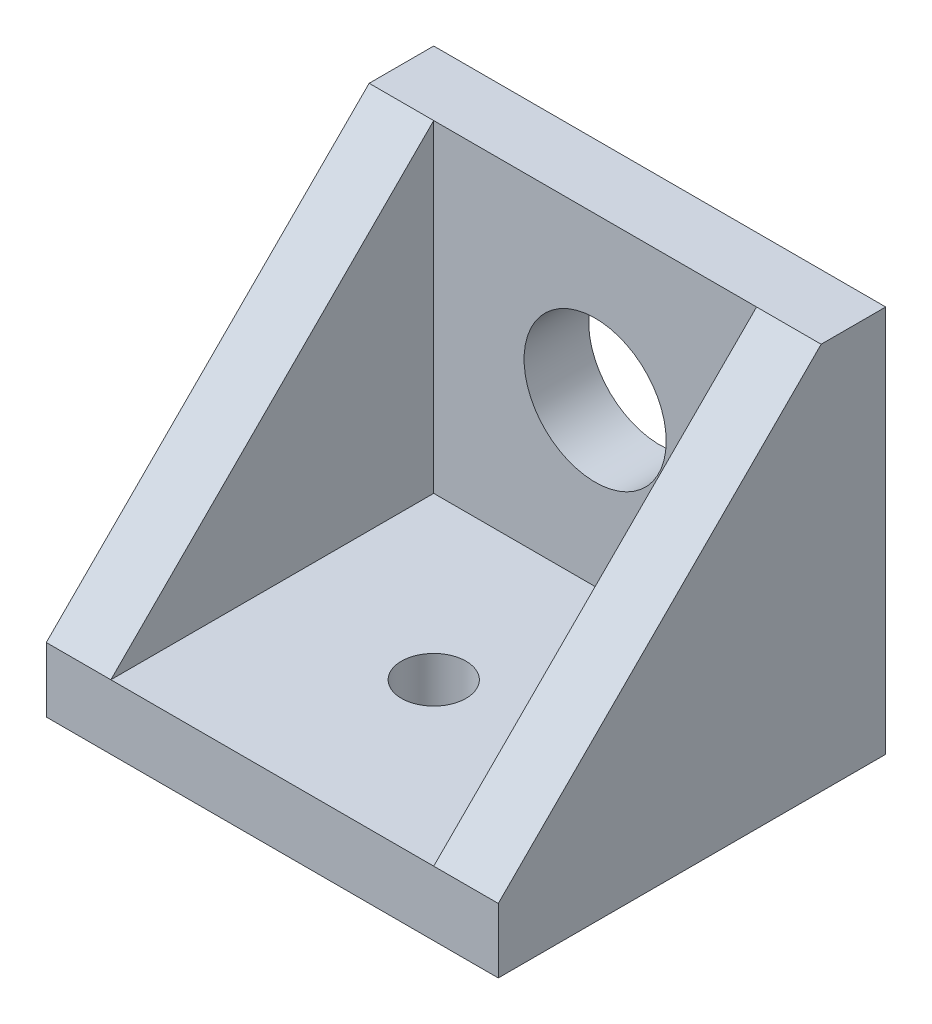
ISO-10303-21;
HEADER;
FILE_DESCRIPTION(('STEP AP214'),'2;1');
FILE_NAME('part.step','',(''),(''),'','','');
FILE_SCHEMA(('AUTOMOTIVE_DESIGN { 1 0 10303 214 1 1 1 1 }'));
ENDSEC;
DATA;
#1=APPLICATION_CONTEXT('core data for automotive mechanical design processes');
#2=APPLICATION_PROTOCOL_DEFINITION('international standard','automotive_design',2000,#1);
#3=PRODUCT_CONTEXT('',#1,'mechanical');
#4=PRODUCT('Part','Part','',(#3));
#5=PRODUCT_RELATED_PRODUCT_CATEGORY('part','',(#4));
#6=PRODUCT_DEFINITION_FORMATION('','',#4);
#7=PRODUCT_DEFINITION_CONTEXT('part definition',#1,'design');
#8=PRODUCT_DEFINITION('design','',#6,#7);
#9=PRODUCT_DEFINITION_SHAPE('','',#8);
#10=(LENGTH_UNIT() NAMED_UNIT(*) SI_UNIT(.MILLI.,.METRE.));
#11=(NAMED_UNIT(*) PLANE_ANGLE_UNIT() SI_UNIT($,.RADIAN.));
#12=(NAMED_UNIT(*) SI_UNIT($,.STERADIAN.) SOLID_ANGLE_UNIT());
#13=UNCERTAINTY_MEASURE_WITH_UNIT(LENGTH_MEASURE(1.E-05),#10,'distance_accuracy_value','');
#14=(GEOMETRIC_REPRESENTATION_CONTEXT(3) GLOBAL_UNCERTAINTY_ASSIGNED_CONTEXT((#13)) GLOBAL_UNIT_ASSIGNED_CONTEXT((#10,
#11,#12)) REPRESENTATION_CONTEXT('',''));
#15=CARTESIAN_POINT('',(0.,0.,0.));
#16=DIRECTION('',(0.,0.,1.));
#17=DIRECTION('',(1.,0.,0.));
#18=AXIS2_PLACEMENT_3D('',#15,#16,#17);
#19=CARTESIAN_POINT('',(0.,0.,3.));
#20=DIRECTION('',(0.,0.,-1.));
#21=DIRECTION('',(-1.,0.,0.));
#22=AXIS2_PLACEMENT_3D('',#19,#20,#21);
#23=PLANE('',#22);
#24=DIRECTION('',(0.,1.,0.));
#25=VECTOR('',#24,1.);
#26=CARTESIAN_POINT('',(7.5,-7.5,3.));
#27=LINE('',#26,#25);
#28=CARTESIAN_POINT('',(7.5,-7.5,3.));
#29=VERTEX_POINT('',#28);
#30=CARTESIAN_POINT('',(7.5,7.5,3.));
#31=VERTEX_POINT('',#30);
#32=EDGE_CURVE('E209',#29,#31,#27,.T.);
#33=ORIENTED_EDGE('',*,*,#32,.T.);
#34=DIRECTION('',(-1.,0.,0.));
#35=VECTOR('',#34,1.);
#36=CARTESIAN_POINT('',(-7.5,7.5,3.));
#37=LINE('',#36,#35);
#38=CARTESIAN_POINT('',(-7.5,7.5,3.));
#39=VERTEX_POINT('',#38);
#40=EDGE_CURVE('E63',#31,#39,#37,.T.);
#41=ORIENTED_EDGE('',*,*,#40,.T.);
#42=DIRECTION('',(0.,-1.,0.));
#43=VECTOR('',#42,1.);
#44=CARTESIAN_POINT('',(-7.5,-7.5,3.));
#45=LINE('',#44,#43);
#46=CARTESIAN_POINT('',(-7.5,-7.5,3.));
#47=VERTEX_POINT('',#46);
#48=EDGE_CURVE('E49',#39,#47,#45,.T.);
#49=ORIENTED_EDGE('',*,*,#48,.T.);
#50=DIRECTION('',(1.,0.,0.));
#51=VECTOR('',#50,1.);
#52=CARTESIAN_POINT('',(-7.5,-7.5,3.));
#53=LINE('',#52,#51);
#54=EDGE_CURVE('E11',#47,#29,#53,.T.);
#55=ORIENTED_EDGE('',*,*,#54,.T.);
#56=EDGE_LOOP('',(#33,#41,#49,#55));
#57=FACE_BOUND('',#56,.T.);
#58=CARTESIAN_POINT('',(0.,0.,3.));
#59=DIRECTION('',(0.,0.,1.));
#60=DIRECTION('',(1.,0.,0.));
#61=AXIS2_PLACEMENT_3D('',#58,#59,#60);
#62=CIRCLE('',#61,3.302);
#63=CARTESIAN_POINT('',(3.302,0.,3.));
#64=VERTEX_POINT('',#63);
#65=EDGE_CURVE('E202',#64,#64,#62,.T.);
#66=ORIENTED_EDGE('',*,*,#65,.F.);
#67=EDGE_LOOP('',(#66));
#68=FACE_BOUND('',#67,.T.);
#69=ADVANCED_FACE('F39',(#57,#68),#23,.F.);
#70=CARTESIAN_POINT('',(0.,0.,0.));
#71=DIRECTION('',(0.,0.,-1.));
#72=DIRECTION('',(-1.,0.,0.));
#73=AXIS2_PLACEMENT_3D('',#70,#71,#72);
#74=PLANE('',#73);
#75=DIRECTION('',(-1.,0.,0.));
#76=VECTOR('',#75,1.);
#77=CARTESIAN_POINT('',(-7.5,7.5,0.));
#78=LINE('',#77,#76);
#79=CARTESIAN_POINT('',(10.5,7.5,0.));
#80=VERTEX_POINT('',#79);
#81=CARTESIAN_POINT('',(-10.5,7.5,0.));
#82=VERTEX_POINT('',#81);
#83=EDGE_CURVE('E43',#80,#82,#78,.T.);
#84=ORIENTED_EDGE('',*,*,#83,.F.);
#85=DIRECTION('',(0.,1.,0.));
#86=VECTOR('',#85,1.);
#87=CARTESIAN_POINT('',(10.5,-10.5,0.));
#88=LINE('',#87,#86);
#89=CARTESIAN_POINT('',(10.5,-10.5,0.));
#90=VERTEX_POINT('',#89);
#91=EDGE_CURVE('E160',#90,#80,#88,.T.);
#92=ORIENTED_EDGE('',*,*,#91,.F.);
#93=DIRECTION('',(1.,0.,0.));
#94=VECTOR('',#93,1.);
#95=CARTESIAN_POINT('',(-7.5,-10.5,0.));
#96=LINE('',#95,#94);
#97=CARTESIAN_POINT('',(-10.5,-10.5,0.));
#98=VERTEX_POINT('',#97);
#99=EDGE_CURVE('E187',#98,#90,#96,.T.);
#100=ORIENTED_EDGE('',*,*,#99,.F.);
#101=DIRECTION('',(0.,1.,0.));
#102=VECTOR('',#101,1.);
#103=CARTESIAN_POINT('',(-10.5,-10.5,0.));
#104=LINE('',#103,#102);
#105=EDGE_CURVE('E133',#98,#82,#104,.T.);
#106=ORIENTED_EDGE('',*,*,#105,.T.);
#107=EDGE_LOOP('',(#84,#92,#100,#106));
#108=FACE_BOUND('',#107,.T.);
#109=CARTESIAN_POINT('',(0.,0.,0.));
#110=DIRECTION('',(0.,0.,1.));
#111=DIRECTION('',(1.,0.,0.));
#112=AXIS2_PLACEMENT_3D('',#109,#110,#111);
#113=CIRCLE('',#112,3.302);
#114=CARTESIAN_POINT('',(3.302,0.,0.));
#115=VERTEX_POINT('',#114);
#116=EDGE_CURVE('E194',#115,#115,#113,.T.);
#117=ORIENTED_EDGE('',*,*,#116,.T.);
#118=EDGE_LOOP('',(#117));
#119=FACE_BOUND('',#118,.T.);
#120=ADVANCED_FACE('F239',(#108,#119),#74,.T.);
#121=CARTESIAN_POINT('',(-7.5,7.5,3.));
#122=DIRECTION('',(0.,-1.,0.));
#123=DIRECTION('',(0.,0.,-1.));
#124=AXIS2_PLACEMENT_3D('',#121,#122,#123);
#125=PLANE('',#124);
#126=ORIENTED_EDGE('',*,*,#83,.T.);
#127=DIRECTION('',(0.,0.,1.));
#128=VECTOR('',#127,1.);
#129=CARTESIAN_POINT('',(-10.5,7.5,3.));
#130=LINE('',#129,#128);
#131=CARTESIAN_POINT('',(-10.5,7.5,3.));
#132=VERTEX_POINT('',#131);
#133=EDGE_CURVE('E124',#82,#132,#130,.T.);
#134=ORIENTED_EDGE('',*,*,#133,.T.);
#135=DIRECTION('',(1.,0.,0.));
#136=VECTOR('',#135,1.);
#137=CARTESIAN_POINT('',(-10.5,7.5,3.));
#138=LINE('',#137,#136);
#139=EDGE_CURVE('E108',#132,#39,#138,.T.);
#140=ORIENTED_EDGE('',*,*,#139,.T.);
#141=ORIENTED_EDGE('',*,*,#40,.F.);
#142=DIRECTION('',(-1.,0.,0.));
#143=VECTOR('',#142,1.);
#144=CARTESIAN_POINT('',(10.5,7.5,3.));
#145=LINE('',#144,#143);
#146=CARTESIAN_POINT('',(10.5,7.5,3.));
#147=VERTEX_POINT('',#146);
#148=EDGE_CURVE('E167',#147,#31,#145,.T.);
#149=ORIENTED_EDGE('',*,*,#148,.F.);
#150=DIRECTION('',(0.,0.,1.));
#151=VECTOR('',#150,1.);
#152=CARTESIAN_POINT('',(10.5,7.5,3.));
#153=LINE('',#152,#151);
#154=EDGE_CURVE('E164',#80,#147,#153,.T.);
#155=ORIENTED_EDGE('',*,*,#154,.F.);
#156=EDGE_LOOP('',(#126,#134,#140,#141,#149,#155));
#157=FACE_BOUND('',#156,.T.);
#158=ADVANCED_FACE('F41',(#157),#125,.F.);
#159=CARTESIAN_POINT('',(0.,0.,3.));
#160=DIRECTION('',(0.,0.,-1.));
#161=DIRECTION('',(-1.,0.,0.));
#162=AXIS2_PLACEMENT_3D('',#159,#160,#161);
#163=CYLINDRICAL_SURFACE('',#162,3.302);
#164=ORIENTED_EDGE('',*,*,#65,.T.);
#165=EDGE_LOOP('',(#164));
#166=FACE_BOUND('',#165,.T.);
#167=ORIENTED_EDGE('',*,*,#116,.F.);
#168=EDGE_LOOP('',(#167));
#169=FACE_BOUND('',#168,.T.);
#170=ADVANCED_FACE('F225',(#166,#169),#163,.F.);
#171=CARTESIAN_POINT('',(0.,-7.5,0.));
#172=DIRECTION('',(0.,1.,0.));
#173=DIRECTION('',(0.,0.,1.));
#174=AXIS2_PLACEMENT_3D('',#171,#172,#173);
#175=PLANE('',#174);
#176=CARTESIAN_POINT('',(0.,-7.5,10.5));
#177=DIRECTION('',(0.,-1.,0.));
#178=DIRECTION('',(0.,0.,-1.));
#179=AXIS2_PLACEMENT_3D('',#176,#177,#178);
#180=CIRCLE('',#179,1.5);
#181=CARTESIAN_POINT('',(0.,-7.5,9.));
#182=VERTEX_POINT('',#181);
#183=EDGE_CURVE('E178',#182,#182,#180,.T.);
#184=ORIENTED_EDGE('',*,*,#183,.T.);
#185=EDGE_LOOP('',(#184));
#186=FACE_BOUND('',#185,.T.);
#187=ORIENTED_EDGE('',*,*,#54,.F.);
#188=DIRECTION('',(0.,0.,-1.));
#189=VECTOR('',#188,1.);
#190=CARTESIAN_POINT('',(-7.5,-7.5,0.));
#191=LINE('',#190,#189);
#192=CARTESIAN_POINT('',(-7.5,-7.5,18.));
#193=VERTEX_POINT('',#192);
#194=EDGE_CURVE('E183',#193,#47,#191,.T.);
#195=ORIENTED_EDGE('',*,*,#194,.F.);
#196=DIRECTION('',(-1.,0.,0.));
#197=VECTOR('',#196,1.);
#198=CARTESIAN_POINT('',(-7.5,-7.5,18.));
#199=LINE('',#198,#197);
#200=CARTESIAN_POINT('',(7.5,-7.5,18.));
#201=VERTEX_POINT('',#200);
#202=EDGE_CURVE('E191',#201,#193,#199,.T.);
#203=ORIENTED_EDGE('',*,*,#202,.F.);
#204=DIRECTION('',(0.,0.,1.));
#205=VECTOR('',#204,1.);
#206=CARTESIAN_POINT('',(7.50000000000001,-7.5,0.));
#207=LINE('',#206,#205);
#208=EDGE_CURVE('E56',#29,#201,#207,.T.);
#209=ORIENTED_EDGE('',*,*,#208,.F.);
#210=EDGE_LOOP('',(#187,#195,#203,#209));
#211=FACE_BOUND('',#210,.T.);
#212=ADVANCED_FACE('F222',(#186,#211),#175,.T.);
#213=CARTESIAN_POINT('',(0.,-10.5,0.));
#214=DIRECTION('',(0.,1.,0.));
#215=DIRECTION('',(0.,0.,1.));
#216=AXIS2_PLACEMENT_3D('',#213,#214,#215);
#217=PLANE('',#216);
#218=DIRECTION('',(-1.,0.,0.));
#219=VECTOR('',#218,1.);
#220=CARTESIAN_POINT('',(-7.5,-10.5,18.));
#221=LINE('',#220,#219);
#222=CARTESIAN_POINT('',(10.5,-10.5,18.));
#223=VERTEX_POINT('',#222);
#224=CARTESIAN_POINT('',(-10.5,-10.5,18.));
#225=VERTEX_POINT('',#224);
#226=EDGE_CURVE('E190',#223,#225,#221,.T.);
#227=ORIENTED_EDGE('',*,*,#226,.T.);
#228=DIRECTION('',(0.,0.,-1.));
#229=VECTOR('',#228,1.);
#230=CARTESIAN_POINT('',(-10.5,-10.5,0.));
#231=LINE('',#230,#229);
#232=EDGE_CURVE('E136',#225,#98,#231,.T.);
#233=ORIENTED_EDGE('',*,*,#232,.T.);
#234=ORIENTED_EDGE('',*,*,#99,.T.);
#235=DIRECTION('',(0.,0.,-1.));
#236=VECTOR('',#235,1.);
#237=CARTESIAN_POINT('',(10.5,-10.5,0.));
#238=LINE('',#237,#236);
#239=EDGE_CURVE('E156',#223,#90,#238,.T.);
#240=ORIENTED_EDGE('',*,*,#239,.F.);
#241=EDGE_LOOP('',(#227,#233,#234,#240));
#242=FACE_BOUND('',#241,.T.);
#243=CARTESIAN_POINT('',(0.,-10.5,10.5));
#244=DIRECTION('',(0.,-1.,0.));
#245=DIRECTION('',(0.,0.,-1.));
#246=AXIS2_PLACEMENT_3D('',#243,#244,#245);
#247=CIRCLE('',#246,1.5);
#248=CARTESIAN_POINT('',(0.,-10.5,9.));
#249=VERTEX_POINT('',#248);
#250=EDGE_CURVE('E179',#249,#249,#247,.T.);
#251=ORIENTED_EDGE('',*,*,#250,.F.);
#252=EDGE_LOOP('',(#251));
#253=FACE_BOUND('',#252,.T.);
#254=ADVANCED_FACE('F224',(#242,#253),#217,.F.);
#255=CARTESIAN_POINT('',(-7.5,-10.5,18.));
#256=DIRECTION('',(0.,0.,-1.));
#257=DIRECTION('',(-1.,0.,0.));
#258=AXIS2_PLACEMENT_3D('',#255,#256,#257);
#259=PLANE('',#258);
#260=ORIENTED_EDGE('',*,*,#202,.T.);
#261=DIRECTION('',(1.,0.,0.));
#262=VECTOR('',#261,1.);
#263=CARTESIAN_POINT('',(-10.5,-7.5,18.));
#264=LINE('',#263,#262);
#265=CARTESIAN_POINT('',(-10.5,-7.5,18.));
#266=VERTEX_POINT('',#265);
#267=EDGE_CURVE('E118',#266,#193,#264,.T.);
#268=ORIENTED_EDGE('',*,*,#267,.F.);
#269=DIRECTION('',(0.,-1.,0.));
#270=VECTOR('',#269,1.);
#271=CARTESIAN_POINT('',(-10.5,-10.5,18.));
#272=LINE('',#271,#270);
#273=EDGE_CURVE('E128',#266,#225,#272,.T.);
#274=ORIENTED_EDGE('',*,*,#273,.T.);
#275=ORIENTED_EDGE('',*,*,#226,.F.);
#276=DIRECTION('',(0.,-1.,0.));
#277=VECTOR('',#276,1.);
#278=CARTESIAN_POINT('',(10.5,-10.5,18.));
#279=LINE('',#278,#277);
#280=CARTESIAN_POINT('',(10.5,-7.5,18.));
#281=VERTEX_POINT('',#280);
#282=EDGE_CURVE('E152',#281,#223,#279,.T.);
#283=ORIENTED_EDGE('',*,*,#282,.F.);
#284=DIRECTION('',(-1.,0.,0.));
#285=VECTOR('',#284,1.);
#286=CARTESIAN_POINT('',(10.5,-7.5,18.));
#287=LINE('',#286,#285);
#288=EDGE_CURVE('E174',#281,#201,#287,.T.);
#289=ORIENTED_EDGE('',*,*,#288,.T.);
#290=EDGE_LOOP('',(#260,#268,#274,#275,#283,#289));
#291=FACE_BOUND('',#290,.T.);
#292=ADVANCED_FACE('F232',(#291),#259,.F.);
#293=CARTESIAN_POINT('',(0.,-10.5,10.5));
#294=DIRECTION('',(0.,1.,0.));
#295=DIRECTION('',(0.,0.,1.));
#296=AXIS2_PLACEMENT_3D('',#293,#294,#295);
#297=CYLINDRICAL_SURFACE('',#296,1.5);
#298=ORIENTED_EDGE('',*,*,#250,.T.);
#299=EDGE_LOOP('',(#298));
#300=FACE_BOUND('',#299,.T.);
#301=ORIENTED_EDGE('',*,*,#183,.F.);
#302=EDGE_LOOP('',(#301));
#303=FACE_BOUND('',#302,.T.);
#304=ADVANCED_FACE('F246',(#300,#303),#297,.F.);
#305=CARTESIAN_POINT('',(7.5,0.,0.));
#306=DIRECTION('',(-1.,0.,0.));
#307=DIRECTION('',(0.,0.,1.));
#308=AXIS2_PLACEMENT_3D('',#305,#306,#307);
#309=PLANE('',#308);
#310=ORIENTED_EDGE('',*,*,#32,.F.);
#311=ORIENTED_EDGE('',*,*,#208,.T.);
#312=DIRECTION('',(0.,-0.707106781186547,0.707106781186548));
#313=VECTOR('',#312,1.);
#314=CARTESIAN_POINT('',(7.5,-7.5,18.));
#315=LINE('',#314,#313);
#316=EDGE_CURVE('E117',#31,#201,#315,.T.);
#317=ORIENTED_EDGE('',*,*,#316,.F.);
#318=EDGE_LOOP('',(#310,#311,#317));
#319=FACE_BOUND('',#318,.T.);
#320=ADVANCED_FACE('F251',(#319),#309,.T.);
#321=CARTESIAN_POINT('',(10.5,-7.5,18.));
#322=DIRECTION('',(0.,-0.707106781186548,-0.707106781186547));
#323=DIRECTION('',(0.,0.707106781186547,-0.707106781186548));
#324=AXIS2_PLACEMENT_3D('',#321,#322,#323);
#325=PLANE('',#324);
#326=ORIENTED_EDGE('',*,*,#316,.T.);
#327=ORIENTED_EDGE('',*,*,#288,.F.);
#328=DIRECTION('',(0.,-0.707106781186547,0.707106781186548));
#329=VECTOR('',#328,1.);
#330=CARTESIAN_POINT('',(10.5,-7.5,18.));
#331=LINE('',#330,#329);
#332=EDGE_CURVE('E148',#147,#281,#331,.T.);
#333=ORIENTED_EDGE('',*,*,#332,.F.);
#334=ORIENTED_EDGE('',*,*,#148,.T.);
#335=EDGE_LOOP('',(#326,#327,#333,#334));
#336=FACE_BOUND('',#335,.T.);
#337=ADVANCED_FACE('F259',(#336),#325,.F.);
#338=CARTESIAN_POINT('',(10.5,0.,0.));
#339=DIRECTION('',(-1.,0.,0.));
#340=DIRECTION('',(0.,0.,1.));
#341=AXIS2_PLACEMENT_3D('',#338,#339,#340);
#342=PLANE('',#341);
#343=ORIENTED_EDGE('',*,*,#332,.T.);
#344=ORIENTED_EDGE('',*,*,#282,.T.);
#345=ORIENTED_EDGE('',*,*,#239,.T.);
#346=ORIENTED_EDGE('',*,*,#91,.T.);
#347=ORIENTED_EDGE('',*,*,#154,.T.);
#348=EDGE_LOOP('',(#343,#344,#345,#346,#347));
#349=FACE_BOUND('',#348,.T.);
#350=ADVANCED_FACE('F261',(#349),#342,.F.);
#351=CARTESIAN_POINT('',(-10.5,-7.5,18.));
#352=DIRECTION('',(0.,0.707106781186548,0.707106781186547));
#353=DIRECTION('',(0.,-0.707106781186547,0.707106781186548));
#354=AXIS2_PLACEMENT_3D('',#351,#352,#353);
#355=PLANE('',#354);
#356=DIRECTION('',(0.,-0.707106781186547,0.707106781186548));
#357=VECTOR('',#356,1.);
#358=CARTESIAN_POINT('',(-7.5,-7.5,18.));
#359=LINE('',#358,#357);
#360=EDGE_CURVE('E114',#39,#193,#359,.T.);
#361=ORIENTED_EDGE('',*,*,#360,.F.);
#362=ORIENTED_EDGE('',*,*,#139,.F.);
#363=DIRECTION('',(0.,-0.707106781186547,0.707106781186548));
#364=VECTOR('',#363,1.);
#365=CARTESIAN_POINT('',(-10.5,-7.5,18.));
#366=LINE('',#365,#364);
#367=EDGE_CURVE('E111',#132,#266,#366,.T.);
#368=ORIENTED_EDGE('',*,*,#367,.T.);
#369=ORIENTED_EDGE('',*,*,#267,.T.);
#370=EDGE_LOOP('',(#361,#362,#368,#369));
#371=FACE_BOUND('',#370,.T.);
#372=ADVANCED_FACE('F110',(#371),#355,.T.);
#373=CARTESIAN_POINT('',(-10.5,0.,0.));
#374=DIRECTION('',(1.,0.,0.));
#375=DIRECTION('',(0.,0.,1.));
#376=AXIS2_PLACEMENT_3D('',#373,#374,#375);
#377=PLANE('',#376);
#378=ORIENTED_EDGE('',*,*,#367,.F.);
#379=ORIENTED_EDGE('',*,*,#133,.F.);
#380=ORIENTED_EDGE('',*,*,#105,.F.);
#381=ORIENTED_EDGE('',*,*,#232,.F.);
#382=ORIENTED_EDGE('',*,*,#273,.F.);
#383=EDGE_LOOP('',(#378,#379,#380,#381,#382));
#384=FACE_BOUND('',#383,.T.);
#385=ADVANCED_FACE('F122',(#384),#377,.F.);
#386=CARTESIAN_POINT('',(-7.5,0.,0.));
#387=DIRECTION('',(1.,0.,0.));
#388=DIRECTION('',(0.,0.,1.));
#389=AXIS2_PLACEMENT_3D('',#386,#387,#388);
#390=PLANE('',#389);
#391=ORIENTED_EDGE('',*,*,#360,.T.);
#392=ORIENTED_EDGE('',*,*,#194,.T.);
#393=ORIENTED_EDGE('',*,*,#48,.F.);
#394=EDGE_LOOP('',(#391,#392,#393));
#395=FACE_BOUND('',#394,.T.);
#396=ADVANCED_FACE('F220',(#395),#390,.T.);
#397=CLOSED_SHELL('',(#69,#120,#158,#170,#212,#254,#292,#304,#320,#337,#350,#372,#385,#396));
#398=MANIFOLD_SOLID_BREP('B2',#397);
#399=ADVANCED_BREP_SHAPE_REPRESENTATION('',(#18,#398),#14);
#400=SHAPE_DEFINITION_REPRESENTATION(#9,#399);
ENDSEC;
END-ISO-10303-21;
